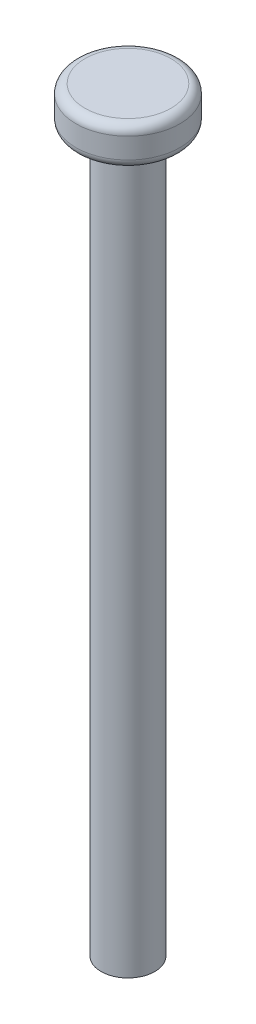
ISO-10303-21;
HEADER;
FILE_DESCRIPTION(('STEP AP214'),'2;1');
FILE_NAME('part.step','',(''),(''),'','','');
FILE_SCHEMA(('AUTOMOTIVE_DESIGN { 1 0 10303 214 1 1 1 1 }'));
ENDSEC;
DATA;
#1=APPLICATION_CONTEXT('core data for automotive mechanical design processes');
#2=APPLICATION_PROTOCOL_DEFINITION('international standard','automotive_design',2000,#1);
#3=PRODUCT_CONTEXT('',#1,'mechanical');
#4=PRODUCT('Part','Part','',(#3));
#5=PRODUCT_RELATED_PRODUCT_CATEGORY('part','',(#4));
#6=PRODUCT_DEFINITION_FORMATION('','',#4);
#7=PRODUCT_DEFINITION_CONTEXT('part definition',#1,'design');
#8=PRODUCT_DEFINITION('design','',#6,#7);
#9=PRODUCT_DEFINITION_SHAPE('','',#8);
#10=(LENGTH_UNIT() NAMED_UNIT(*) SI_UNIT(.MILLI.,.METRE.));
#11=(NAMED_UNIT(*) PLANE_ANGLE_UNIT() SI_UNIT($,.RADIAN.));
#12=(NAMED_UNIT(*) SI_UNIT($,.STERADIAN.) SOLID_ANGLE_UNIT());
#13=UNCERTAINTY_MEASURE_WITH_UNIT(LENGTH_MEASURE(1.E-05),#10,'distance_accuracy_value','');
#14=(GEOMETRIC_REPRESENTATION_CONTEXT(3) GLOBAL_UNCERTAINTY_ASSIGNED_CONTEXT((#13)) GLOBAL_UNIT_ASSIGNED_CONTEXT((#10,
#11,#12)) REPRESENTATION_CONTEXT('',''));
#15=CARTESIAN_POINT('',(0.,0.,0.));
#16=DIRECTION('',(0.,0.,1.));
#17=DIRECTION('',(1.,0.,0.));
#18=AXIS2_PLACEMENT_3D('',#15,#16,#17);
#19=CARTESIAN_POINT('',(0.,80.,0.));
#20=DIRECTION('',(0.,-1.,0.));
#21=DIRECTION('',(0.,0.,-1.));
#22=AXIS2_PLACEMENT_3D('',#19,#20,#21);
#23=CYLINDRICAL_SURFACE('',#22,3.);
#24=CARTESIAN_POINT('',(0.,80.,0.));
#25=DIRECTION('',(0.,1.,0.));
#26=DIRECTION('',(0.,0.,1.));
#27=AXIS2_PLACEMENT_3D('',#24,#25,#26);
#28=CIRCLE('',#27,3.);
#29=CARTESIAN_POINT('',(0.,80.,3.));
#30=VERTEX_POINT('',#29);
#31=EDGE_CURVE('E53',#30,#30,#28,.T.);
#32=ORIENTED_EDGE('',*,*,#31,.F.);
#33=EDGE_LOOP('',(#32));
#34=FACE_BOUND('',#33,.T.);
#35=CARTESIAN_POINT('',(0.,0.,0.));
#36=DIRECTION('',(0.,1.,0.));
#37=DIRECTION('',(0.,0.,1.));
#38=AXIS2_PLACEMENT_3D('',#35,#36,#37);
#39=CIRCLE('',#38,3.);
#40=CARTESIAN_POINT('',(0.,0.,3.));
#41=VERTEX_POINT('',#40);
#42=EDGE_CURVE('E54',#41,#41,#39,.T.);
#43=ORIENTED_EDGE('',*,*,#42,.T.);
#44=EDGE_LOOP('',(#43));
#45=FACE_BOUND('',#44,.T.);
#46=ADVANCED_FACE('F33',(#34,#45),#23,.T.);
#47=CARTESIAN_POINT('',(0.,0.,0.));
#48=DIRECTION('',(0.,1.,0.));
#49=DIRECTION('',(0.,0.,1.));
#50=AXIS2_PLACEMENT_3D('',#47,#48,#49);
#51=PLANE('',#50);
#52=ORIENTED_EDGE('',*,*,#42,.F.);
#53=EDGE_LOOP('',(#52));
#54=FACE_BOUND('',#53,.T.);
#55=ADVANCED_FACE('F64',(#54),#51,.F.);
#56=CARTESIAN_POINT('',(0.,84.3,0.));
#57=DIRECTION('',(0.,-1.,0.));
#58=DIRECTION('',(0.,0.,-1.));
#59=AXIS2_PLACEMENT_3D('',#56,#57,#58);
#60=CYLINDRICAL_SURFACE('',#59,5.8);
#61=CARTESIAN_POINT('',(0.,81.,0.));
#62=DIRECTION('',(0.,1.,0.));
#63=DIRECTION('',(0.,0.,1.));
#64=AXIS2_PLACEMENT_3D('',#61,#62,#63);
#65=CIRCLE('',#64,5.8);
#66=CARTESIAN_POINT('',(0.,81.,5.8));
#67=VERTEX_POINT('',#66);
#68=EDGE_CURVE('E44',#67,#67,#65,.T.);
#69=ORIENTED_EDGE('',*,*,#68,.T.);
#70=EDGE_LOOP('',(#69));
#71=FACE_BOUND('',#70,.T.);
#72=CARTESIAN_POINT('',(0.,83.3,0.));
#73=DIRECTION('',(0.,1.,0.));
#74=DIRECTION('',(0.,0.,1.));
#75=AXIS2_PLACEMENT_3D('',#72,#73,#74);
#76=CIRCLE('',#75,5.8);
#77=CARTESIAN_POINT('',(0.,83.3,5.8));
#78=VERTEX_POINT('',#77);
#79=EDGE_CURVE('E48',#78,#78,#76,.F.);
#80=ORIENTED_EDGE('',*,*,#79,.T.);
#81=EDGE_LOOP('',(#80));
#82=FACE_BOUND('',#81,.T.);
#83=ADVANCED_FACE('F69',(#71,#82),#60,.T.);
#84=CARTESIAN_POINT('',(0.,84.3,0.));
#85=DIRECTION('',(0.,1.,0.));
#86=DIRECTION('',(0.,0.,1.));
#87=AXIS2_PLACEMENT_3D('',#84,#85,#86);
#88=PLANE('',#87);
#89=CARTESIAN_POINT('',(0.,84.3,0.));
#90=DIRECTION('',(0.,1.,0.));
#91=DIRECTION('',(0.,0.,1.));
#92=AXIS2_PLACEMENT_3D('',#89,#90,#91);
#93=CIRCLE('',#92,4.8);
#94=CARTESIAN_POINT('',(0.,84.3,4.8));
#95=VERTEX_POINT('',#94);
#96=EDGE_CURVE('E10',#95,#95,#93,.T.);
#97=ORIENTED_EDGE('',*,*,#96,.T.);
#98=EDGE_LOOP('',(#97));
#99=FACE_BOUND('',#98,.T.);
#100=ADVANCED_FACE('F74',(#99),#88,.T.);
#101=CARTESIAN_POINT('',(0.,80.,0.));
#102=DIRECTION('',(0.,1.,0.));
#103=DIRECTION('',(0.,0.,1.));
#104=AXIS2_PLACEMENT_3D('',#101,#102,#103);
#105=PLANE('',#104);
#106=CARTESIAN_POINT('',(0.,80.,0.));
#107=DIRECTION('',(0.,1.,0.));
#108=DIRECTION('',(0.,0.,1.));
#109=AXIS2_PLACEMENT_3D('',#106,#107,#108);
#110=CIRCLE('',#109,4.8);
#111=CARTESIAN_POINT('',(0.,80.,4.8));
#112=VERTEX_POINT('',#111);
#113=EDGE_CURVE('E40',#112,#112,#110,.F.);
#114=ORIENTED_EDGE('',*,*,#113,.T.);
#115=EDGE_LOOP('',(#114));
#116=FACE_BOUND('',#115,.T.);
#117=ORIENTED_EDGE('',*,*,#31,.T.);
#118=EDGE_LOOP('',(#117));
#119=FACE_BOUND('',#118,.T.);
#120=ADVANCED_FACE('F60',(#116,#119),#105,.F.);
#121=CARTESIAN_POINT('',(0.,81.,0.));
#122=DIRECTION('',(0.,1.,0.));
#123=DIRECTION('',(0.,0.,1.));
#124=AXIS2_PLACEMENT_3D('',#121,#122,#123);
#125=TOROIDAL_SURFACE('',#124,4.8,1.);
#126=ORIENTED_EDGE('',*,*,#113,.F.);
#127=EDGE_LOOP('',(#126));
#128=FACE_BOUND('',#127,.T.);
#129=ORIENTED_EDGE('',*,*,#68,.F.);
#130=EDGE_LOOP('',(#129));
#131=FACE_BOUND('',#130,.T.);
#132=ADVANCED_FACE('F78',(#128,#131),#125,.T.);
#133=CARTESIAN_POINT('',(0.,83.3,0.));
#134=DIRECTION('',(0.,1.,0.));
#135=DIRECTION('',(0.,0.,1.));
#136=AXIS2_PLACEMENT_3D('',#133,#134,#135);
#137=TOROIDAL_SURFACE('',#136,4.8,1.);
#138=ORIENTED_EDGE('',*,*,#79,.F.);
#139=EDGE_LOOP('',(#138));
#140=FACE_BOUND('',#139,.T.);
#141=ORIENTED_EDGE('',*,*,#96,.F.);
#142=EDGE_LOOP('',(#141));
#143=FACE_BOUND('',#142,.T.);
#144=ADVANCED_FACE('F35',(#140,#143),#137,.T.);
#145=CLOSED_SHELL('',(#46,#55,#83,#100,#120,#132,#144));
#146=MANIFOLD_SOLID_BREP('B2',#145);
#147=ADVANCED_BREP_SHAPE_REPRESENTATION('',(#18,#146),#14);
#148=SHAPE_DEFINITION_REPRESENTATION(#9,#147);
ENDSEC;
END-ISO-10303-21;
